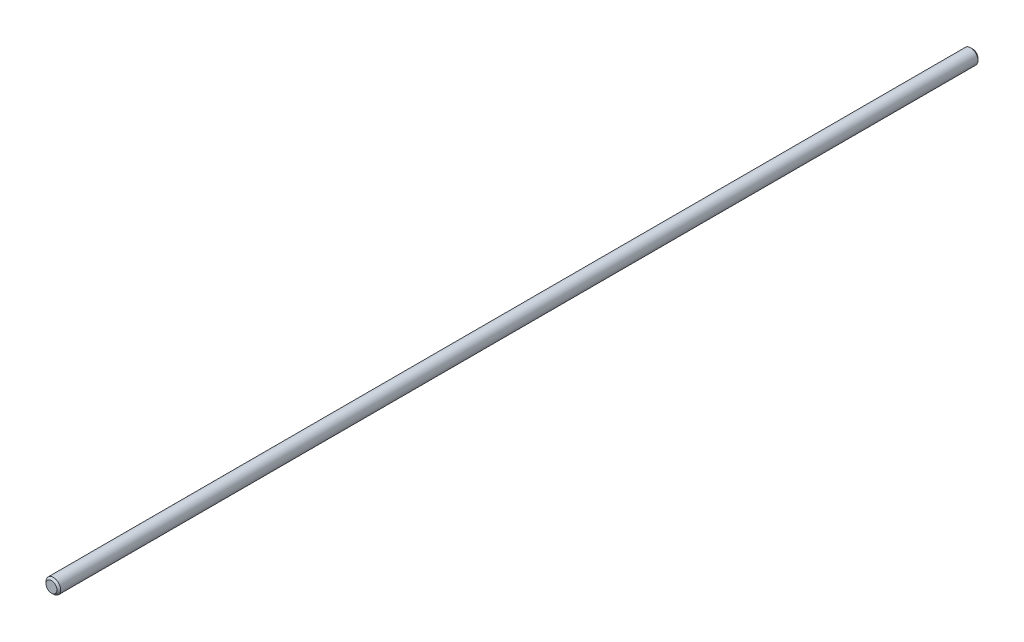
ISO-10303-21;
HEADER;
FILE_DESCRIPTION(('STEP AP214'),'2;1');
FILE_NAME('part.step','',(''),(''),'','','');
FILE_SCHEMA(('AUTOMOTIVE_DESIGN { 1 0 10303 214 1 1 1 1 }'));
ENDSEC;
DATA;
#1=APPLICATION_CONTEXT('core data for automotive mechanical design processes');
#2=APPLICATION_PROTOCOL_DEFINITION('international standard','automotive_design',2000,#1);
#3=PRODUCT_CONTEXT('',#1,'mechanical');
#4=PRODUCT('Part','Part','',(#3));
#5=PRODUCT_RELATED_PRODUCT_CATEGORY('part','',(#4));
#6=PRODUCT_DEFINITION_FORMATION('','',#4);
#7=PRODUCT_DEFINITION_CONTEXT('part definition',#1,'design');
#8=PRODUCT_DEFINITION('design','',#6,#7);
#9=PRODUCT_DEFINITION_SHAPE('','',#8);
#10=(LENGTH_UNIT() NAMED_UNIT(*) SI_UNIT(.MILLI.,.METRE.));
#11=(NAMED_UNIT(*) PLANE_ANGLE_UNIT() SI_UNIT($,.RADIAN.));
#12=(NAMED_UNIT(*) SI_UNIT($,.STERADIAN.) SOLID_ANGLE_UNIT());
#13=UNCERTAINTY_MEASURE_WITH_UNIT(LENGTH_MEASURE(1.E-05),#10,'distance_accuracy_value','');
#14=(GEOMETRIC_REPRESENTATION_CONTEXT(3) GLOBAL_UNCERTAINTY_ASSIGNED_CONTEXT((#13)) GLOBAL_UNIT_ASSIGNED_CONTEXT((#10,
#11,#12)) REPRESENTATION_CONTEXT('',''));
#15=CARTESIAN_POINT('',(0.,0.,0.));
#16=DIRECTION('',(0.,0.,1.));
#17=DIRECTION('',(1.,0.,0.));
#18=AXIS2_PLACEMENT_3D('',#15,#16,#17);
#19=CARTESIAN_POINT('',(0.,0.,500.));
#20=DIRECTION('',(0.,0.,-1.));
#21=DIRECTION('',(-1.,0.,0.));
#22=AXIS2_PLACEMENT_3D('',#19,#20,#21);
#23=CYLINDRICAL_SURFACE('',#22,3.975);
#24=CARTESIAN_POINT('',(0.,0.,0.999999999999945));
#25=DIRECTION('',(0.,0.,1.));
#26=DIRECTION('',(1.,0.,0.));
#27=AXIS2_PLACEMENT_3D('',#24,#25,#26);
#28=CIRCLE('',#27,3.975);
#29=CARTESIAN_POINT('',(3.975,0.,0.999999999999945));
#30=VERTEX_POINT('',#29);
#31=EDGE_CURVE('E49',#30,#30,#28,.T.);
#32=ORIENTED_EDGE('',*,*,#31,.T.);
#33=EDGE_LOOP('',(#32));
#34=FACE_BOUND('',#33,.T.);
#35=CARTESIAN_POINT('',(0.,0.,499.));
#36=DIRECTION('',(0.,0.,1.));
#37=DIRECTION('',(1.,0.,0.));
#38=AXIS2_PLACEMENT_3D('',#35,#36,#37);
#39=CIRCLE('',#38,3.975);
#40=CARTESIAN_POINT('',(3.975,0.,499.));
#41=VERTEX_POINT('',#40);
#42=EDGE_CURVE('E53',#41,#41,#39,.F.);
#43=ORIENTED_EDGE('',*,*,#42,.T.);
#44=EDGE_LOOP('',(#43));
#45=FACE_BOUND('',#44,.T.);
#46=ADVANCED_FACE('F37',(#34,#45),#23,.T.);
#47=CARTESIAN_POINT('',(0.,0.,500.));
#48=DIRECTION('',(0.,0.,1.));
#49=DIRECTION('',(1.,0.,0.));
#50=AXIS2_PLACEMENT_3D('',#47,#48,#49);
#51=PLANE('',#50);
#52=CARTESIAN_POINT('',(0.,0.,500.));
#53=DIRECTION('',(0.,0.,1.));
#54=DIRECTION('',(1.,0.,0.));
#55=AXIS2_PLACEMENT_3D('',#52,#53,#54);
#56=CIRCLE('',#55,2.97500000000006);
#57=CARTESIAN_POINT('',(2.97500000000006,0.,500.));
#58=VERTEX_POINT('',#57);
#59=EDGE_CURVE('E10',#58,#58,#56,.T.);
#60=ORIENTED_EDGE('',*,*,#59,.T.);
#61=EDGE_LOOP('',(#60));
#62=FACE_BOUND('',#61,.T.);
#63=ADVANCED_FACE('F69',(#62),#51,.T.);
#64=CARTESIAN_POINT('',(0.,0.,0.));
#65=DIRECTION('',(0.,0.,1.));
#66=DIRECTION('',(1.,0.,0.));
#67=AXIS2_PLACEMENT_3D('',#64,#65,#66);
#68=PLANE('',#67);
#69=CARTESIAN_POINT('',(0.,0.,0.));
#70=DIRECTION('',(0.,0.,1.));
#71=DIRECTION('',(1.,0.,0.));
#72=AXIS2_PLACEMENT_3D('',#69,#70,#71);
#73=CIRCLE('',#72,2.97500000000006);
#74=CARTESIAN_POINT('',(2.97500000000006,0.,0.));
#75=VERTEX_POINT('',#74);
#76=EDGE_CURVE('E45',#75,#75,#73,.F.);
#77=ORIENTED_EDGE('',*,*,#76,.T.);
#78=EDGE_LOOP('',(#77));
#79=FACE_BOUND('',#78,.T.);
#80=ADVANCED_FACE('F66',(#79),#68,.F.);
#81=CARTESIAN_POINT('',(0.,0.,0.999999999999945));
#82=DIRECTION('',(0.,0.,1.));
#83=DIRECTION('',(1.,0.,0.));
#84=AXIS2_PLACEMENT_3D('',#81,#82,#83);
#85=CONICAL_SURFACE('',#84,3.975,0.785398163397445);
#86=ORIENTED_EDGE('',*,*,#76,.F.);
#87=EDGE_LOOP('',(#86));
#88=FACE_BOUND('',#87,.T.);
#89=ORIENTED_EDGE('',*,*,#31,.F.);
#90=EDGE_LOOP('',(#89));
#91=FACE_BOUND('',#90,.T.);
#92=ADVANCED_FACE('F62',(#88,#91),#85,.T.);
#93=CARTESIAN_POINT('',(0.,0.,500.));
#94=DIRECTION('',(0.,0.,-1.));
#95=DIRECTION('',(-1.,0.,0.));
#96=AXIS2_PLACEMENT_3D('',#93,#94,#95);
#97=CONICAL_SURFACE('',#96,2.97500000000006,0.785398163397445);
#98=ORIENTED_EDGE('',*,*,#42,.F.);
#99=EDGE_LOOP('',(#98));
#100=FACE_BOUND('',#99,.T.);
#101=ORIENTED_EDGE('',*,*,#59,.F.);
#102=EDGE_LOOP('',(#101));
#103=FACE_BOUND('',#102,.T.);
#104=ADVANCED_FACE('F40',(#100,#103),#97,.T.);
#105=CLOSED_SHELL('',(#46,#63,#80,#92,#104));
#106=MANIFOLD_SOLID_BREP('B2',#105);
#107=ADVANCED_BREP_SHAPE_REPRESENTATION('',(#18,#106),#14);
#108=SHAPE_DEFINITION_REPRESENTATION(#9,#107);
ENDSEC;
END-ISO-10303-21;
